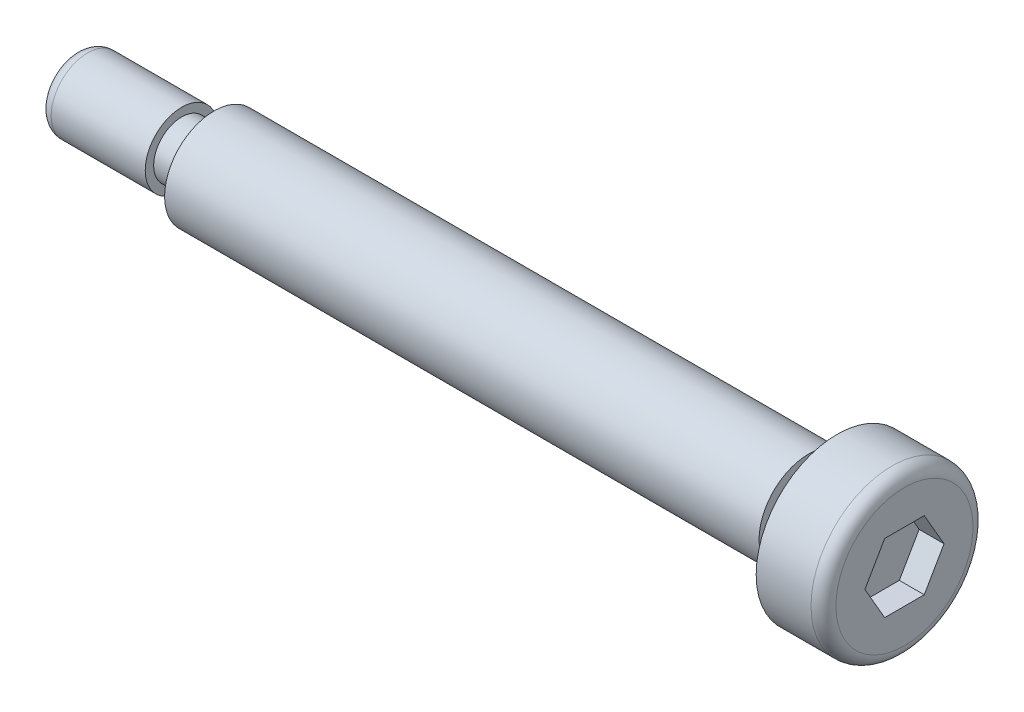
ISO-10303-21;
HEADER;
FILE_DESCRIPTION(('STEP AP214'),'2;1');
FILE_NAME('part.step','',(''),(''),'','','');
FILE_SCHEMA(('AUTOMOTIVE_DESIGN { 1 0 10303 214 1 1 1 1 }'));
ENDSEC;
DATA;
#1=APPLICATION_CONTEXT('core data for automotive mechanical design processes');
#2=APPLICATION_PROTOCOL_DEFINITION('international standard','automotive_design',2000,#1);
#3=PRODUCT_CONTEXT('',#1,'mechanical');
#4=PRODUCT('Part','Part','',(#3));
#5=PRODUCT_RELATED_PRODUCT_CATEGORY('part','',(#4));
#6=PRODUCT_DEFINITION_FORMATION('','',#4);
#7=PRODUCT_DEFINITION_CONTEXT('part definition',#1,'design');
#8=PRODUCT_DEFINITION('design','',#6,#7);
#9=PRODUCT_DEFINITION_SHAPE('','',#8);
#10=(LENGTH_UNIT() NAMED_UNIT(*) SI_UNIT(.MILLI.,.METRE.));
#11=(NAMED_UNIT(*) PLANE_ANGLE_UNIT() SI_UNIT($,.RADIAN.));
#12=(NAMED_UNIT(*) SI_UNIT($,.STERADIAN.) SOLID_ANGLE_UNIT());
#13=UNCERTAINTY_MEASURE_WITH_UNIT(LENGTH_MEASURE(1.E-05),#10,'distance_accuracy_value','');
#14=(GEOMETRIC_REPRESENTATION_CONTEXT(3) GLOBAL_UNCERTAINTY_ASSIGNED_CONTEXT((#13)) GLOBAL_UNIT_ASSIGNED_CONTEXT((#10,
#11,#12)) REPRESENTATION_CONTEXT('',''));
#15=CARTESIAN_POINT('',(0.,0.,0.));
#16=DIRECTION('',(0.,0.,1.));
#17=DIRECTION('',(1.,0.,0.));
#18=AXIS2_PLACEMENT_3D('',#15,#16,#17);
#19=CARTESIAN_POINT('',(-50.,3.97,0.));
#20=DIRECTION('',(1.,0.,0.));
#21=DIRECTION('',(0.,0.,-1.));
#22=AXIS2_PLACEMENT_3D('',#19,#20,#21);
#23=PLANE('',#22);
#24=CARTESIAN_POINT('',(-50.,0.,0.));
#25=DIRECTION('',(-1.,0.,0.));
#26=DIRECTION('',(0.,0.,1.));
#27=AXIS2_PLACEMENT_3D('',#24,#25,#26);
#28=CIRCLE('',#27,2.25);
#29=CARTESIAN_POINT('',(-50.,0.,2.25));
#30=VERTEX_POINT('',#29);
#31=EDGE_CURVE('E11',#30,#30,#28,.T.);
#32=ORIENTED_EDGE('',*,*,#31,.F.);
#33=EDGE_LOOP('',(#32));
#34=FACE_BOUND('',#33,.T.);
#35=CARTESIAN_POINT('',(-50.,0.,0.));
#36=DIRECTION('',(-1.,0.,0.));
#37=DIRECTION('',(0.,0.,1.));
#38=AXIS2_PLACEMENT_3D('',#35,#36,#37);
#39=CIRCLE('',#38,3.97);
#40=CARTESIAN_POINT('',(-50.,0.,3.97));
#41=VERTEX_POINT('',#40);
#42=EDGE_CURVE('E154',#41,#41,#39,.T.);
#43=ORIENTED_EDGE('',*,*,#42,.T.);
#44=EDGE_LOOP('',(#43));
#45=FACE_BOUND('',#44,.T.);
#46=ADVANCED_FACE('F38',(#34,#45),#23,.F.);
#47=CARTESIAN_POINT('',(-61.15,0.,0.));
#48=DIRECTION('',(-1.,0.,0.));
#49=DIRECTION('',(0.,0.,1.));
#50=AXIS2_PLACEMENT_3D('',#47,#48,#49);
#51=CYLINDRICAL_SURFACE('',#50,2.25);
#52=CARTESIAN_POINT('',(-52.6,0.,0.));
#53=DIRECTION('',(-1.,0.,0.));
#54=DIRECTION('',(0.,0.,1.));
#55=AXIS2_PLACEMENT_3D('',#52,#53,#54);
#56=CIRCLE('',#55,2.25);
#57=CARTESIAN_POINT('',(-52.6,0.,2.25));
#58=VERTEX_POINT('',#57);
#59=EDGE_CURVE('E46',#58,#58,#56,.T.);
#60=ORIENTED_EDGE('',*,*,#59,.F.);
#61=EDGE_LOOP('',(#60));
#62=FACE_BOUND('',#61,.T.);
#63=ORIENTED_EDGE('',*,*,#31,.T.);
#64=EDGE_LOOP('',(#63));
#65=FACE_BOUND('',#64,.T.);
#66=ADVANCED_FACE('F207',(#62,#65),#51,.T.);
#67=CARTESIAN_POINT('',(-52.6,2.25,0.));
#68=DIRECTION('',(-1.,0.,0.));
#69=DIRECTION('',(0.,0.,1.));
#70=AXIS2_PLACEMENT_3D('',#67,#68,#69);
#71=PLANE('',#70);
#72=CARTESIAN_POINT('',(-52.6,0.,0.));
#73=DIRECTION('',(-1.,0.,0.));
#74=DIRECTION('',(0.,0.,1.));
#75=AXIS2_PLACEMENT_3D('',#72,#73,#74);
#76=CIRCLE('',#75,2.925);
#77=CARTESIAN_POINT('',(-52.6,0.,2.925));
#78=VERTEX_POINT('',#77);
#79=EDGE_CURVE('E198',#78,#78,#76,.T.);
#80=ORIENTED_EDGE('',*,*,#79,.F.);
#81=EDGE_LOOP('',(#80));
#82=FACE_BOUND('',#81,.T.);
#83=ORIENTED_EDGE('',*,*,#59,.T.);
#84=EDGE_LOOP('',(#83));
#85=FACE_BOUND('',#84,.T.);
#86=ADVANCED_FACE('F205',(#82,#85),#71,.F.);
#87=CARTESIAN_POINT('',(-61.15,0.,0.));
#88=DIRECTION('',(-1.,0.,0.));
#89=DIRECTION('',(0.,0.,1.));
#90=AXIS2_PLACEMENT_3D('',#87,#88,#89);
#91=CYLINDRICAL_SURFACE('',#90,2.925);
#92=CARTESIAN_POINT('',(-60.15,0.,0.));
#93=DIRECTION('',(-1.,0.,0.));
#94=DIRECTION('',(0.,0.,1.));
#95=AXIS2_PLACEMENT_3D('',#92,#93,#94);
#96=CIRCLE('',#95,2.925);
#97=CARTESIAN_POINT('',(-60.15,0.,2.925));
#98=VERTEX_POINT('',#97);
#99=EDGE_CURVE('E194',#98,#98,#96,.T.);
#100=ORIENTED_EDGE('',*,*,#99,.F.);
#101=EDGE_LOOP('',(#100));
#102=FACE_BOUND('',#101,.T.);
#103=ORIENTED_EDGE('',*,*,#79,.T.);
#104=EDGE_LOOP('',(#103));
#105=FACE_BOUND('',#104,.T.);
#106=ADVANCED_FACE('F268',(#102,#105),#91,.T.);
#107=CARTESIAN_POINT('',(-60.15,0.,0.));
#108=DIRECTION('',(-1.,0.,0.));
#109=DIRECTION('',(0.,0.,1.));
#110=AXIS2_PLACEMENT_3D('',#107,#108,#109);
#111=TOROIDAL_SURFACE('',#110,1.925,1.);
#112=CARTESIAN_POINT('',(-61.15,0.,0.));
#113=DIRECTION('',(-1.,0.,0.));
#114=DIRECTION('',(0.,0.,1.));
#115=AXIS2_PLACEMENT_3D('',#112,#113,#114);
#116=CIRCLE('',#115,1.92499999999999);
#117=CARTESIAN_POINT('',(-61.15,0.,1.92499999999999));
#118=VERTEX_POINT('',#117);
#119=EDGE_CURVE('E190',#118,#118,#116,.T.);
#120=ORIENTED_EDGE('',*,*,#119,.F.);
#121=EDGE_LOOP('',(#120));
#122=FACE_BOUND('',#121,.T.);
#123=ORIENTED_EDGE('',*,*,#99,.T.);
#124=EDGE_LOOP('',(#123));
#125=FACE_BOUND('',#124,.T.);
#126=ADVANCED_FACE('F261',(#122,#125),#111,.T.);
#127=CARTESIAN_POINT('',(-61.15,1.92499999999999,0.));
#128=DIRECTION('',(1.,0.,0.));
#129=DIRECTION('',(0.,0.,-1.));
#130=AXIS2_PLACEMENT_3D('',#127,#128,#129);
#131=PLANE('',#130);
#132=ORIENTED_EDGE('',*,*,#119,.T.);
#133=EDGE_LOOP('',(#132));
#134=FACE_BOUND('',#133,.T.);
#135=ADVANCED_FACE('F255',(#134),#131,.F.);
#136=CARTESIAN_POINT('',(5.4,5.49999999999999,0.));
#137=DIRECTION('',(-1.,0.,0.));
#138=DIRECTION('',(0.,0.,1.));
#139=AXIS2_PLACEMENT_3D('',#136,#137,#138);
#140=PLANE('',#139);
#141=DIRECTION('',(0.,0.,1.));
#142=VECTOR('',#141,1.);
#143=CARTESIAN_POINT('',(5.4,2.75,-1.58771324027147));
#144=LINE('',#143,#142);
#145=CARTESIAN_POINT('',(5.4,2.75,-1.58771324027147));
#146=VERTEX_POINT('',#145);
#147=CARTESIAN_POINT('',(5.4,2.75,1.58771324027147));
#148=VERTEX_POINT('',#147);
#149=EDGE_CURVE('E135',#146,#148,#144,.T.);
#150=ORIENTED_EDGE('',*,*,#149,.F.);
#151=DIRECTION('',(0.,0.866025403784439,0.5));
#152=VECTOR('',#151,1.);
#153=CARTESIAN_POINT('',(5.4,0.,-3.17542648054294));
#154=LINE('',#153,#152);
#155=CARTESIAN_POINT('',(5.4,0.,-3.17542648054294));
#156=VERTEX_POINT('',#155);
#157=EDGE_CURVE('E53',#156,#146,#154,.T.);
#158=ORIENTED_EDGE('',*,*,#157,.F.);
#159=DIRECTION('',(0.,0.866025403784439,-0.5));
#160=VECTOR('',#159,1.);
#161=CARTESIAN_POINT('',(5.4,-2.75,-1.58771324027147));
#162=LINE('',#161,#160);
#163=CARTESIAN_POINT('',(5.4,-2.75,-1.58771324027147));
#164=VERTEX_POINT('',#163);
#165=EDGE_CURVE('E148',#164,#156,#162,.T.);
#166=ORIENTED_EDGE('',*,*,#165,.F.);
#167=DIRECTION('',(0.,0.,-1.));
#168=VECTOR('',#167,1.);
#169=CARTESIAN_POINT('',(5.4,-2.75,1.58771324027147));
#170=LINE('',#169,#168);
#171=CARTESIAN_POINT('',(5.4,-2.75,1.58771324027147));
#172=VERTEX_POINT('',#171);
#173=EDGE_CURVE('E145',#172,#164,#170,.T.);
#174=ORIENTED_EDGE('',*,*,#173,.F.);
#175=DIRECTION('',(0.,-0.866025403784438,-0.5));
#176=VECTOR('',#175,1.);
#177=CARTESIAN_POINT('',(5.4,0.,3.17542648054294));
#178=LINE('',#177,#176);
#179=CARTESIAN_POINT('',(5.4,0.,3.17542648054294));
#180=VERTEX_POINT('',#179);
#181=EDGE_CURVE('E101',#180,#172,#178,.T.);
#182=ORIENTED_EDGE('',*,*,#181,.F.);
#183=DIRECTION('',(0.,-0.866025403784439,0.5));
#184=VECTOR('',#183,1.);
#185=CARTESIAN_POINT('',(5.4,2.75,1.58771324027147));
#186=LINE('',#185,#184);
#187=EDGE_CURVE('E139',#148,#180,#186,.T.);
#188=ORIENTED_EDGE('',*,*,#187,.F.);
#189=EDGE_LOOP('',(#150,#158,#166,#174,#182,#188));
#190=FACE_BOUND('',#189,.T.);
#191=CARTESIAN_POINT('',(5.4,0.,0.));
#192=DIRECTION('',(-1.,0.,0.));
#193=DIRECTION('',(0.,0.,1.));
#194=AXIS2_PLACEMENT_3D('',#191,#192,#193);
#195=CIRCLE('',#194,5.49999999999999);
#196=CARTESIAN_POINT('',(5.4,0.,5.49999999999999));
#197=VERTEX_POINT('',#196);
#198=EDGE_CURVE('E186',#197,#197,#195,.T.);
#199=ORIENTED_EDGE('',*,*,#198,.F.);
#200=EDGE_LOOP('',(#199));
#201=FACE_BOUND('',#200,.T.);
#202=ADVANCED_FACE('F250',(#190,#201),#140,.F.);
#203=CARTESIAN_POINT('',(4.4,0.,0.));
#204=DIRECTION('',(-1.,0.,0.));
#205=DIRECTION('',(0.,0.,1.));
#206=AXIS2_PLACEMENT_3D('',#203,#204,#205);
#207=TOROIDAL_SURFACE('',#206,5.5,1.);
#208=CARTESIAN_POINT('',(4.39999999999999,0.,0.));
#209=DIRECTION('',(-1.,0.,0.));
#210=DIRECTION('',(0.,0.,1.));
#211=AXIS2_PLACEMENT_3D('',#208,#209,#210);
#212=CIRCLE('',#211,6.5);
#213=CARTESIAN_POINT('',(4.39999999999999,0.,6.5));
#214=VERTEX_POINT('',#213);
#215=EDGE_CURVE('E182',#214,#214,#212,.T.);
#216=ORIENTED_EDGE('',*,*,#215,.F.);
#217=EDGE_LOOP('',(#216));
#218=FACE_BOUND('',#217,.T.);
#219=ORIENTED_EDGE('',*,*,#198,.T.);
#220=EDGE_LOOP('',(#219));
#221=FACE_BOUND('',#220,.T.);
#222=ADVANCED_FACE('F244',(#218,#221),#207,.T.);
#223=CARTESIAN_POINT('',(-61.15,0.,0.));
#224=DIRECTION('',(-1.,0.,0.));
#225=DIRECTION('',(0.,0.,1.));
#226=AXIS2_PLACEMENT_3D('',#223,#224,#225);
#227=CYLINDRICAL_SURFACE('',#226,6.5);
#228=CARTESIAN_POINT('',(0.,0.,0.));
#229=DIRECTION('',(-1.,0.,0.));
#230=DIRECTION('',(0.,0.,1.));
#231=AXIS2_PLACEMENT_3D('',#228,#229,#230);
#232=CIRCLE('',#231,6.5);
#233=CARTESIAN_POINT('',(0.,0.,6.5));
#234=VERTEX_POINT('',#233);
#235=EDGE_CURVE('E178',#234,#234,#232,.T.);
#236=ORIENTED_EDGE('',*,*,#235,.F.);
#237=EDGE_LOOP('',(#236));
#238=FACE_BOUND('',#237,.T.);
#239=ORIENTED_EDGE('',*,*,#215,.T.);
#240=EDGE_LOOP('',(#239));
#241=FACE_BOUND('',#240,.T.);
#242=ADVANCED_FACE('F238',(#238,#241),#227,.T.);
#243=CARTESIAN_POINT('',(0.,3.25,0.));
#244=DIRECTION('',(1.,0.,0.));
#245=DIRECTION('',(0.,0.,-1.));
#246=AXIS2_PLACEMENT_3D('',#243,#244,#245);
#247=PLANE('',#246);
#248=CARTESIAN_POINT('',(0.,0.,0.));
#249=DIRECTION('',(-1.,0.,0.));
#250=DIRECTION('',(0.,0.,1.));
#251=AXIS2_PLACEMENT_3D('',#248,#249,#250);
#252=CIRCLE('',#251,3.25);
#253=CARTESIAN_POINT('',(0.,0.,3.25));
#254=VERTEX_POINT('',#253);
#255=EDGE_CURVE('E174',#254,#254,#252,.T.);
#256=ORIENTED_EDGE('',*,*,#255,.F.);
#257=EDGE_LOOP('',(#256));
#258=FACE_BOUND('',#257,.T.);
#259=ORIENTED_EDGE('',*,*,#235,.T.);
#260=EDGE_LOOP('',(#259));
#261=FACE_BOUND('',#260,.T.);
#262=ADVANCED_FACE('F232',(#258,#261),#247,.F.);
#263=CARTESIAN_POINT('',(-61.15,0.,0.));
#264=DIRECTION('',(-1.,0.,0.));
#265=DIRECTION('',(0.,0.,1.));
#266=AXIS2_PLACEMENT_3D('',#263,#264,#265);
#267=CYLINDRICAL_SURFACE('',#266,3.25);
#268=CARTESIAN_POINT('',(-2.3,0.,0.));
#269=DIRECTION('',(-1.,0.,0.));
#270=DIRECTION('',(0.,0.,1.));
#271=AXIS2_PLACEMENT_3D('',#268,#269,#270);
#272=CIRCLE('',#271,3.25);
#273=CARTESIAN_POINT('',(-2.3,0.,3.25));
#274=VERTEX_POINT('',#273);
#275=EDGE_CURVE('E171',#274,#274,#272,.T.);
#276=ORIENTED_EDGE('',*,*,#275,.F.);
#277=EDGE_LOOP('',(#276));
#278=FACE_BOUND('',#277,.T.);
#279=ORIENTED_EDGE('',*,*,#255,.T.);
#280=EDGE_LOOP('',(#279));
#281=FACE_BOUND('',#280,.T.);
#282=ADVANCED_FACE('F226',(#278,#281),#267,.T.);
#283=CARTESIAN_POINT('',(-2.3,3.97,0.));
#284=DIRECTION('',(-1.,0.,0.));
#285=DIRECTION('',(0.,0.,1.));
#286=AXIS2_PLACEMENT_3D('',#283,#284,#285);
#287=PLANE('',#286);
#288=CARTESIAN_POINT('',(-2.3,0.,0.));
#289=DIRECTION('',(-1.,0.,0.));
#290=DIRECTION('',(0.,0.,1.));
#291=AXIS2_PLACEMENT_3D('',#288,#289,#290);
#292=CIRCLE('',#291,3.97);
#293=CARTESIAN_POINT('',(-2.3,0.,3.97));
#294=VERTEX_POINT('',#293);
#295=EDGE_CURVE('E167',#294,#294,#292,.T.);
#296=ORIENTED_EDGE('',*,*,#295,.F.);
#297=EDGE_LOOP('',(#296));
#298=FACE_BOUND('',#297,.T.);
#299=ORIENTED_EDGE('',*,*,#275,.T.);
#300=EDGE_LOOP('',(#299));
#301=FACE_BOUND('',#300,.T.);
#302=ADVANCED_FACE('F220',(#298,#301),#287,.F.);
#303=CARTESIAN_POINT('',(-61.15,0.,0.));
#304=DIRECTION('',(-1.,0.,0.));
#305=DIRECTION('',(0.,0.,1.));
#306=AXIS2_PLACEMENT_3D('',#303,#304,#305);
#307=CYLINDRICAL_SURFACE('',#306,3.97);
#308=ORIENTED_EDGE('',*,*,#42,.F.);
#309=EDGE_LOOP('',(#308));
#310=FACE_BOUND('',#309,.T.);
#311=ORIENTED_EDGE('',*,*,#295,.T.);
#312=EDGE_LOOP('',(#311));
#313=FACE_BOUND('',#312,.T.);
#314=ADVANCED_FACE('F216',(#310,#313),#307,.T.);
#315=CARTESIAN_POINT('',(3.4,0.,-3.17542648054294));
#316=DIRECTION('',(0.,0.5,-0.866025403784439));
#317=DIRECTION('',(0.,0.866025403784439,0.5));
#318=AXIS2_PLACEMENT_3D('',#315,#316,#317);
#319=PLANE('',#318);
#320=ORIENTED_EDGE('',*,*,#157,.T.);
#321=DIRECTION('',(1.,0.,0.));
#322=VECTOR('',#321,1.);
#323=CARTESIAN_POINT('',(3.4,2.75,-1.58771324027147));
#324=LINE('',#323,#322);
#325=CARTESIAN_POINT('',(3.4,2.75,-1.58771324027147));
#326=VERTEX_POINT('',#325);
#327=EDGE_CURVE('E83',#326,#146,#324,.T.);
#328=ORIENTED_EDGE('',*,*,#327,.F.);
#329=DIRECTION('',(0.,0.866025403784439,0.5));
#330=VECTOR('',#329,1.);
#331=CARTESIAN_POINT('',(3.4,0.,-3.17542648054294));
#332=LINE('',#331,#330);
#333=CARTESIAN_POINT('',(3.4,0.,-3.17542648054294));
#334=VERTEX_POINT('',#333);
#335=EDGE_CURVE('E151',#334,#326,#332,.T.);
#336=ORIENTED_EDGE('',*,*,#335,.F.);
#337=DIRECTION('',(1.,0.,0.));
#338=VECTOR('',#337,1.);
#339=CARTESIAN_POINT('',(3.4,0.,-3.17542648054294));
#340=LINE('',#339,#338);
#341=EDGE_CURVE('E61',#334,#156,#340,.T.);
#342=ORIENTED_EDGE('',*,*,#341,.T.);
#343=EDGE_LOOP('',(#320,#328,#336,#342));
#344=FACE_BOUND('',#343,.T.);
#345=ADVANCED_FACE('F219',(#344),#319,.F.);
#346=CARTESIAN_POINT('',(3.4,-2.75,-1.58771324027147));
#347=DIRECTION('',(0.,-0.5,-0.866025403784439));
#348=DIRECTION('',(0.,0.866025403784439,-0.5));
#349=AXIS2_PLACEMENT_3D('',#346,#347,#348);
#350=PLANE('',#349);
#351=ORIENTED_EDGE('',*,*,#165,.T.);
#352=ORIENTED_EDGE('',*,*,#341,.F.);
#353=DIRECTION('',(0.,0.866025403784439,-0.5));
#354=VECTOR('',#353,1.);
#355=CARTESIAN_POINT('',(3.4,-2.75,-1.58771324027147));
#356=LINE('',#355,#354);
#357=CARTESIAN_POINT('',(3.4,-2.75,-1.58771324027147));
#358=VERTEX_POINT('',#357);
#359=EDGE_CURVE('E115',#358,#334,#356,.T.);
#360=ORIENTED_EDGE('',*,*,#359,.F.);
#361=DIRECTION('',(1.,0.,0.));
#362=VECTOR('',#361,1.);
#363=CARTESIAN_POINT('',(3.4,-2.75,-1.58771324027147));
#364=LINE('',#363,#362);
#365=EDGE_CURVE('E106',#358,#164,#364,.T.);
#366=ORIENTED_EDGE('',*,*,#365,.T.);
#367=EDGE_LOOP('',(#351,#352,#360,#366));
#368=FACE_BOUND('',#367,.T.);
#369=ADVANCED_FACE('F330',(#368),#350,.F.);
#370=CARTESIAN_POINT('',(3.4,-2.75,1.58771324027147));
#371=DIRECTION('',(0.,-1.,0.));
#372=DIRECTION('',(0.,0.,-1.));
#373=AXIS2_PLACEMENT_3D('',#370,#371,#372);
#374=PLANE('',#373);
#375=ORIENTED_EDGE('',*,*,#173,.T.);
#376=ORIENTED_EDGE('',*,*,#365,.F.);
#377=DIRECTION('',(0.,0.,-1.));
#378=VECTOR('',#377,1.);
#379=CARTESIAN_POINT('',(3.4,-2.75,1.58771324027147));
#380=LINE('',#379,#378);
#381=CARTESIAN_POINT('',(3.4,-2.75,1.58771324027147));
#382=VERTEX_POINT('',#381);
#383=EDGE_CURVE('E110',#382,#358,#380,.T.);
#384=ORIENTED_EDGE('',*,*,#383,.F.);
#385=DIRECTION('',(1.,0.,0.));
#386=VECTOR('',#385,1.);
#387=CARTESIAN_POINT('',(3.4,-2.75,1.58771324027147));
#388=LINE('',#387,#386);
#389=EDGE_CURVE('E94',#382,#172,#388,.T.);
#390=ORIENTED_EDGE('',*,*,#389,.T.);
#391=EDGE_LOOP('',(#375,#376,#384,#390));
#392=FACE_BOUND('',#391,.T.);
#393=ADVANCED_FACE('F111',(#392),#374,.F.);
#394=CARTESIAN_POINT('',(3.4,0.,3.17542648054294));
#395=DIRECTION('',(0.,-0.5,0.866025403784438));
#396=DIRECTION('',(0.,-0.866025403784439,-0.5));
#397=AXIS2_PLACEMENT_3D('',#394,#395,#396);
#398=PLANE('',#397);
#399=ORIENTED_EDGE('',*,*,#181,.T.);
#400=ORIENTED_EDGE('',*,*,#389,.F.);
#401=DIRECTION('',(0.,-0.866025403784438,-0.5));
#402=VECTOR('',#401,1.);
#403=CARTESIAN_POINT('',(3.4,0.,3.17542648054294));
#404=LINE('',#403,#402);
#405=CARTESIAN_POINT('',(3.4,0.,3.17542648054294));
#406=VERTEX_POINT('',#405);
#407=EDGE_CURVE('E98',#406,#382,#404,.T.);
#408=ORIENTED_EDGE('',*,*,#407,.F.);
#409=DIRECTION('',(1.,0.,0.));
#410=VECTOR('',#409,1.);
#411=CARTESIAN_POINT('',(3.4,0.,3.17542648054294));
#412=LINE('',#411,#410);
#413=EDGE_CURVE('E107',#406,#180,#412,.T.);
#414=ORIENTED_EDGE('',*,*,#413,.T.);
#415=EDGE_LOOP('',(#399,#400,#408,#414));
#416=FACE_BOUND('',#415,.T.);
#417=ADVANCED_FACE('F96',(#416),#398,.F.);
#418=CARTESIAN_POINT('',(3.4,2.75,1.58771324027147));
#419=DIRECTION('',(0.,0.5,0.866025403784439));
#420=DIRECTION('',(0.,-0.866025403784439,0.5));
#421=AXIS2_PLACEMENT_3D('',#418,#419,#420);
#422=PLANE('',#421);
#423=ORIENTED_EDGE('',*,*,#187,.T.);
#424=ORIENTED_EDGE('',*,*,#413,.F.);
#425=DIRECTION('',(0.,-0.866025403784439,0.5));
#426=VECTOR('',#425,1.);
#427=CARTESIAN_POINT('',(3.4,2.75,1.58771324027147));
#428=LINE('',#427,#426);
#429=CARTESIAN_POINT('',(3.4,2.75,1.58771324027147));
#430=VERTEX_POINT('',#429);
#431=EDGE_CURVE('E121',#430,#406,#428,.T.);
#432=ORIENTED_EDGE('',*,*,#431,.F.);
#433=DIRECTION('',(1.,0.,0.));
#434=VECTOR('',#433,1.);
#435=CARTESIAN_POINT('',(3.4,2.75,1.58771324027147));
#436=LINE('',#435,#434);
#437=EDGE_CURVE('E159',#430,#148,#436,.T.);
#438=ORIENTED_EDGE('',*,*,#437,.T.);
#439=EDGE_LOOP('',(#423,#424,#432,#438));
#440=FACE_BOUND('',#439,.T.);
#441=ADVANCED_FACE('F352',(#440),#422,.F.);
#442=CARTESIAN_POINT('',(3.4,2.75,-1.58771324027147));
#443=DIRECTION('',(0.,1.,0.));
#444=DIRECTION('',(0.,0.,1.));
#445=AXIS2_PLACEMENT_3D('',#442,#443,#444);
#446=PLANE('',#445);
#447=ORIENTED_EDGE('',*,*,#149,.T.);
#448=ORIENTED_EDGE('',*,*,#437,.F.);
#449=DIRECTION('',(0.,0.,1.));
#450=VECTOR('',#449,1.);
#451=CARTESIAN_POINT('',(3.4,2.75,-1.58771324027147));
#452=LINE('',#451,#450);
#453=EDGE_CURVE('E127',#326,#430,#452,.T.);
#454=ORIENTED_EDGE('',*,*,#453,.F.);
#455=ORIENTED_EDGE('',*,*,#327,.T.);
#456=EDGE_LOOP('',(#447,#448,#454,#455));
#457=FACE_BOUND('',#456,.T.);
#458=ADVANCED_FACE('F360',(#457),#446,.F.);
#459=CARTESIAN_POINT('',(3.4,0.,0.));
#460=DIRECTION('',(1.,0.,0.));
#461=DIRECTION('',(0.,0.,-1.));
#462=AXIS2_PLACEMENT_3D('',#459,#460,#461);
#463=PLANE('',#462);
#464=ORIENTED_EDGE('',*,*,#335,.T.);
#465=ORIENTED_EDGE('',*,*,#453,.T.);
#466=ORIENTED_EDGE('',*,*,#431,.T.);
#467=ORIENTED_EDGE('',*,*,#407,.T.);
#468=ORIENTED_EDGE('',*,*,#383,.T.);
#469=ORIENTED_EDGE('',*,*,#359,.T.);
#470=EDGE_LOOP('',(#464,#465,#466,#467,#468,#469));
#471=FACE_BOUND('',#470,.T.);
#472=ADVANCED_FACE('F118',(#471),#463,.T.);
#473=CLOSED_SHELL('',(#46,#66,#86,#106,#126,#135,#202,#222,#242,#262,#282,#302,#314,#345,#369,
#393,#417,#441,#458,#472));
#474=MANIFOLD_SOLID_BREP('B2',#473);
#475=ADVANCED_BREP_SHAPE_REPRESENTATION('',(#18,#474),#14);
#476=SHAPE_DEFINITION_REPRESENTATION(#9,#475);
ENDSEC;
END-ISO-10303-21;
